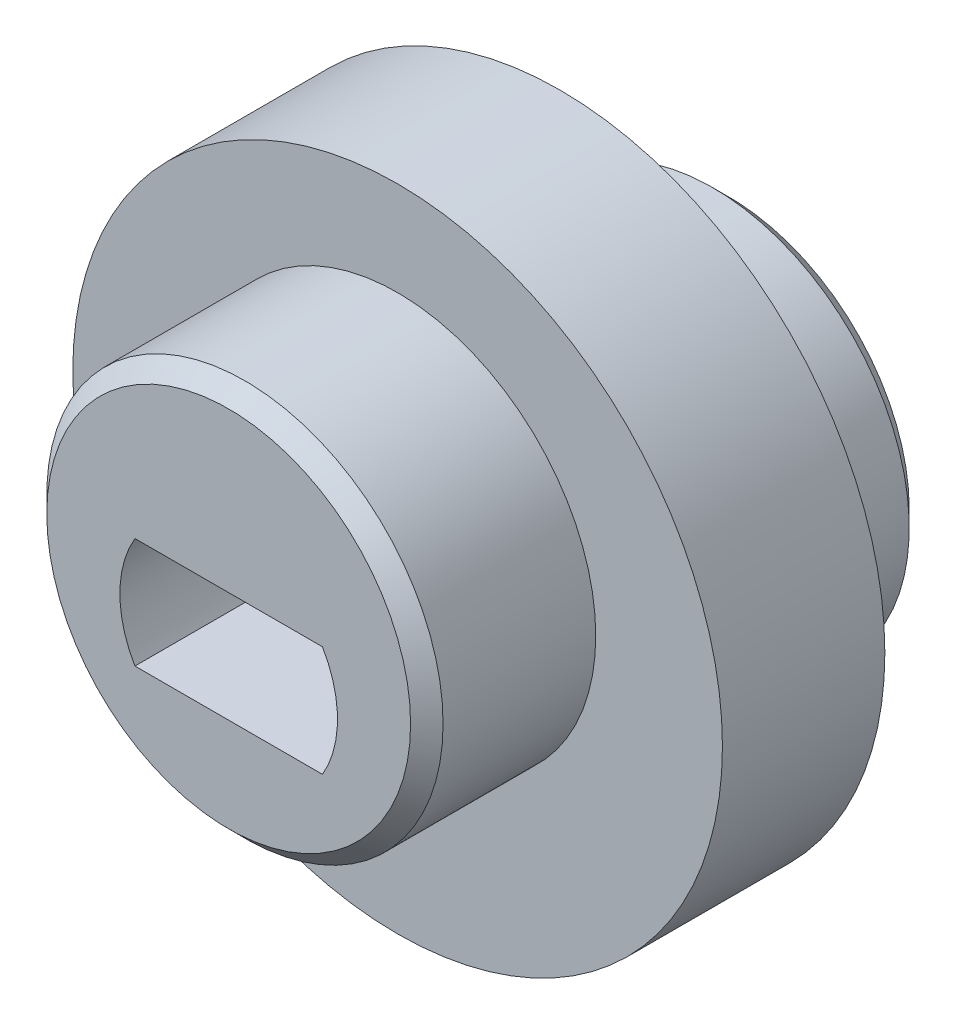
ISO-10303-21;
HEADER;
FILE_DESCRIPTION(('STEP AP214'),'2;1');
FILE_NAME('part.step','',(''),(''),'','','');
FILE_SCHEMA(('AUTOMOTIVE_DESIGN { 1 0 10303 214 1 1 1 1 }'));
ENDSEC;
DATA;
#1=APPLICATION_CONTEXT('core data for automotive mechanical design processes');
#2=APPLICATION_PROTOCOL_DEFINITION('international standard','automotive_design',2000,#1);
#3=PRODUCT_CONTEXT('',#1,'mechanical');
#4=PRODUCT('Part','Part','',(#3));
#5=PRODUCT_RELATED_PRODUCT_CATEGORY('part','',(#4));
#6=PRODUCT_DEFINITION_FORMATION('','',#4);
#7=PRODUCT_DEFINITION_CONTEXT('part definition',#1,'design');
#8=PRODUCT_DEFINITION('design','',#6,#7);
#9=PRODUCT_DEFINITION_SHAPE('','',#8);
#10=(LENGTH_UNIT() NAMED_UNIT(*) SI_UNIT(.MILLI.,.METRE.));
#11=(NAMED_UNIT(*) PLANE_ANGLE_UNIT() SI_UNIT($,.RADIAN.));
#12=(NAMED_UNIT(*) SI_UNIT($,.STERADIAN.) SOLID_ANGLE_UNIT());
#13=UNCERTAINTY_MEASURE_WITH_UNIT(LENGTH_MEASURE(1.E-05),#10,'distance_accuracy_value','');
#14=(GEOMETRIC_REPRESENTATION_CONTEXT(3) GLOBAL_UNCERTAINTY_ASSIGNED_CONTEXT((#13)) GLOBAL_UNIT_ASSIGNED_CONTEXT((#10,
#11,#12)) REPRESENTATION_CONTEXT('',''));
#15=CARTESIAN_POINT('',(0.,0.,0.));
#16=DIRECTION('',(0.,0.,1.));
#17=DIRECTION('',(1.,0.,0.));
#18=AXIS2_PLACEMENT_3D('',#15,#16,#17);
#19=CARTESIAN_POINT('',(0.,0.,2.5));
#20=DIRECTION('',(0.,0.,1.));
#21=DIRECTION('',(1.,0.,0.));
#22=AXIS2_PLACEMENT_3D('',#19,#20,#21);
#23=PLANE('',#22);
#24=CARTESIAN_POINT('',(0.,1.,2.5));
#25=DIRECTION('',(0.,0.,1.));
#26=DIRECTION('',(1.,0.,0.));
#27=AXIS2_PLACEMENT_3D('',#24,#25,#26);
#28=CIRCLE('',#27,6.1);
#29=CARTESIAN_POINT('',(6.1,1.,2.5));
#30=VERTEX_POINT('',#29);
#31=EDGE_CURVE('E127',#30,#30,#28,.T.);
#32=ORIENTED_EDGE('',*,*,#31,.F.);
#33=EDGE_LOOP('',(#32));
#34=FACE_BOUND('',#33,.T.);
#35=CARTESIAN_POINT('',(0.,0.,2.5));
#36=DIRECTION('',(0.,0.,1.));
#37=DIRECTION('',(1.,0.,0.));
#38=AXIS2_PLACEMENT_3D('',#35,#36,#37);
#39=CIRCLE('',#38,10.);
#40=CARTESIAN_POINT('',(10.,0.,2.5));
#41=VERTEX_POINT('',#40);
#42=EDGE_CURVE('E116',#41,#41,#39,.T.);
#43=ORIENTED_EDGE('',*,*,#42,.T.);
#44=EDGE_LOOP('',(#43));
#45=FACE_BOUND('',#44,.T.);
#46=ADVANCED_FACE('F41',(#34,#45),#23,.T.);
#47=CARTESIAN_POINT('',(0.,1.,7.7));
#48=DIRECTION('',(0.,0.,-1.));
#49=DIRECTION('',(-1.,0.,0.));
#50=AXIS2_PLACEMENT_3D('',#47,#48,#49);
#51=CYLINDRICAL_SURFACE('',#50,6.1);
#52=CARTESIAN_POINT('',(0.,1.,7.2));
#53=DIRECTION('',(0.,0.,1.));
#54=DIRECTION('',(1.,0.,0.));
#55=AXIS2_PLACEMENT_3D('',#52,#53,#54);
#56=CIRCLE('',#55,6.1);
#57=CARTESIAN_POINT('',(6.1,1.,7.2));
#58=VERTEX_POINT('',#57);
#59=EDGE_CURVE('E11',#58,#58,#56,.F.);
#60=ORIENTED_EDGE('',*,*,#59,.T.);
#61=EDGE_LOOP('',(#60));
#62=FACE_BOUND('',#61,.T.);
#63=ORIENTED_EDGE('',*,*,#31,.T.);
#64=EDGE_LOOP('',(#63));
#65=FACE_BOUND('',#64,.T.);
#66=ADVANCED_FACE('F148',(#62,#65),#51,.T.);
#67=CARTESIAN_POINT('',(0.,1.,7.7));
#68=DIRECTION('',(0.,0.,1.));
#69=DIRECTION('',(1.,0.,0.));
#70=AXIS2_PLACEMENT_3D('',#67,#68,#69);
#71=PLANE('',#70);
#72=CARTESIAN_POINT('',(0.,1.,7.7));
#73=DIRECTION('',(0.,0.,1.));
#74=DIRECTION('',(1.,0.,0.));
#75=AXIS2_PLACEMENT_3D('',#72,#73,#74);
#76=CIRCLE('',#75,5.6);
#77=CARTESIAN_POINT('',(5.6,1.,7.7));
#78=VERTEX_POINT('',#77);
#79=EDGE_CURVE('E50',#78,#78,#76,.T.);
#80=ORIENTED_EDGE('',*,*,#79,.T.);
#81=EDGE_LOOP('',(#80));
#82=FACE_BOUND('',#81,.T.);
#83=CARTESIAN_POINT('',(0.,0.,7.7));
#84=DIRECTION('',(0.,0.,1.));
#85=DIRECTION('',(1.,0.,0.));
#86=AXIS2_PLACEMENT_3D('',#83,#84,#85);
#87=CIRCLE('',#86,3.35);
#88=CARTESIAN_POINT('',(-2.88660700477221,1.7,7.7));
#89=VERTEX_POINT('',#88);
#90=CARTESIAN_POINT('',(-2.88660700477221,-1.7,7.7));
#91=VERTEX_POINT('',#90);
#92=EDGE_CURVE('E57',#89,#91,#87,.T.);
#93=ORIENTED_EDGE('',*,*,#92,.F.);
#94=DIRECTION('',(-1.,0.,0.));
#95=VECTOR('',#94,1.);
#96=CARTESIAN_POINT('',(-2.88660700477221,1.7,7.7));
#97=LINE('',#96,#95);
#98=CARTESIAN_POINT('',(2.88660700477221,1.7,7.7));
#99=VERTEX_POINT('',#98);
#100=EDGE_CURVE('E100',#99,#89,#97,.T.);
#101=ORIENTED_EDGE('',*,*,#100,.F.);
#102=CARTESIAN_POINT('',(0.,0.,7.7));
#103=DIRECTION('',(0.,0.,1.));
#104=DIRECTION('',(1.,0.,0.));
#105=AXIS2_PLACEMENT_3D('',#102,#103,#104);
#106=CIRCLE('',#105,3.35);
#107=CARTESIAN_POINT('',(2.88660700477221,-1.7,7.7));
#108=VERTEX_POINT('',#107);
#109=EDGE_CURVE('E85',#108,#99,#106,.T.);
#110=ORIENTED_EDGE('',*,*,#109,.F.);
#111=DIRECTION('',(1.,0.,0.));
#112=VECTOR('',#111,1.);
#113=CARTESIAN_POINT('',(-2.88660700477221,-1.7,7.7));
#114=LINE('',#113,#112);
#115=EDGE_CURVE('E94',#91,#108,#114,.T.);
#116=ORIENTED_EDGE('',*,*,#115,.F.);
#117=EDGE_LOOP('',(#93,#101,#110,#116));
#118=FACE_BOUND('',#117,.T.);
#119=ADVANCED_FACE('F98',(#82,#118),#71,.T.);
#120=CARTESIAN_POINT('',(0.,0.,-30.7842712474619));
#121=DIRECTION('',(0.,0.,1.));
#122=DIRECTION('',(1.,0.,0.));
#123=AXIS2_PLACEMENT_3D('',#120,#121,#122);
#124=CYLINDRICAL_SURFACE('',#123,10.);
#125=CARTESIAN_POINT('',(0.,0.,-2.5));
#126=DIRECTION('',(0.,0.,1.));
#127=DIRECTION('',(1.,0.,0.));
#128=AXIS2_PLACEMENT_3D('',#125,#126,#127);
#129=CIRCLE('',#128,10.);
#130=CARTESIAN_POINT('',(10.,0.,-2.5));
#131=VERTEX_POINT('',#130);
#132=EDGE_CURVE('E121',#131,#131,#129,.F.);
#133=ORIENTED_EDGE('',*,*,#132,.F.);
#134=EDGE_LOOP('',(#133));
#135=FACE_BOUND('',#134,.T.);
#136=ORIENTED_EDGE('',*,*,#42,.F.);
#137=EDGE_LOOP('',(#136));
#138=FACE_BOUND('',#137,.T.);
#139=ADVANCED_FACE('F184',(#135,#138),#124,.T.);
#140=CARTESIAN_POINT('',(0.,-1.,-7.7));
#141=DIRECTION('',(0.,0.,-1.));
#142=DIRECTION('',(-1.,0.,0.));
#143=AXIS2_PLACEMENT_3D('',#140,#141,#142);
#144=PLANE('',#143);
#145=CARTESIAN_POINT('',(0.,-1.,-7.7));
#146=DIRECTION('',(0.,0.,-1.));
#147=DIRECTION('',(-1.,0.,0.));
#148=AXIS2_PLACEMENT_3D('',#145,#146,#147);
#149=CIRCLE('',#148,5.55);
#150=CARTESIAN_POINT('',(-5.55,-1.,-7.7));
#151=VERTEX_POINT('',#150);
#152=EDGE_CURVE('E130',#151,#151,#149,.T.);
#153=ORIENTED_EDGE('',*,*,#152,.T.);
#154=EDGE_LOOP('',(#153));
#155=FACE_BOUND('',#154,.T.);
#156=CARTESIAN_POINT('',(0.,0.,-7.7));
#157=DIRECTION('',(0.,0.,1.));
#158=DIRECTION('',(1.,0.,0.));
#159=AXIS2_PLACEMENT_3D('',#156,#157,#158);
#160=CIRCLE('',#159,3.35);
#161=CARTESIAN_POINT('',(-2.88660700477221,1.7,-7.7));
#162=VERTEX_POINT('',#161);
#163=CARTESIAN_POINT('',(-2.88660700477221,-1.7,-7.7));
#164=VERTEX_POINT('',#163);
#165=EDGE_CURVE('E102',#162,#164,#160,.T.);
#166=ORIENTED_EDGE('',*,*,#165,.T.);
#167=DIRECTION('',(1.,0.,0.));
#168=VECTOR('',#167,1.);
#169=CARTESIAN_POINT('',(-2.88660700477221,-1.7,-7.7));
#170=LINE('',#169,#168);
#171=CARTESIAN_POINT('',(2.88660700477221,-1.7,-7.7));
#172=VERTEX_POINT('',#171);
#173=EDGE_CURVE('E108',#164,#172,#170,.T.);
#174=ORIENTED_EDGE('',*,*,#173,.T.);
#175=CARTESIAN_POINT('',(0.,0.,-7.7));
#176=DIRECTION('',(0.,0.,1.));
#177=DIRECTION('',(1.,0.,0.));
#178=AXIS2_PLACEMENT_3D('',#175,#176,#177);
#179=CIRCLE('',#178,3.35);
#180=CARTESIAN_POINT('',(2.88660700477221,1.7,-7.7));
#181=VERTEX_POINT('',#180);
#182=EDGE_CURVE('E65',#172,#181,#179,.T.);
#183=ORIENTED_EDGE('',*,*,#182,.T.);
#184=DIRECTION('',(-1.,0.,0.));
#185=VECTOR('',#184,1.);
#186=CARTESIAN_POINT('',(-2.88660700477221,1.7,-7.7));
#187=LINE('',#186,#185);
#188=EDGE_CURVE('E111',#181,#162,#187,.T.);
#189=ORIENTED_EDGE('',*,*,#188,.T.);
#190=EDGE_LOOP('',(#166,#174,#183,#189));
#191=FACE_BOUND('',#190,.T.);
#192=ADVANCED_FACE('F177',(#155,#191),#144,.T.);
#193=CARTESIAN_POINT('',(0.,-1.,-7.7));
#194=DIRECTION('',(0.,0.,1.));
#195=DIRECTION('',(1.,0.,0.));
#196=AXIS2_PLACEMENT_3D('',#193,#194,#195);
#197=CYLINDRICAL_SURFACE('',#196,6.05);
#198=CARTESIAN_POINT('',(0.,-1.,-7.2));
#199=DIRECTION('',(0.,0.,-1.));
#200=DIRECTION('',(-1.,0.,0.));
#201=AXIS2_PLACEMENT_3D('',#198,#199,#200);
#202=CIRCLE('',#201,6.05);
#203=CARTESIAN_POINT('',(-6.05,-1.,-7.2));
#204=VERTEX_POINT('',#203);
#205=EDGE_CURVE('E133',#204,#204,#202,.F.);
#206=ORIENTED_EDGE('',*,*,#205,.T.);
#207=EDGE_LOOP('',(#206));
#208=FACE_BOUND('',#207,.T.);
#209=CARTESIAN_POINT('',(0.,-1.,-2.5));
#210=DIRECTION('',(0.,0.,-1.));
#211=DIRECTION('',(-1.,0.,0.));
#212=AXIS2_PLACEMENT_3D('',#209,#210,#211);
#213=CIRCLE('',#212,6.05);
#214=CARTESIAN_POINT('',(-6.05,-1.,-2.5));
#215=VERTEX_POINT('',#214);
#216=EDGE_CURVE('E124',#215,#215,#213,.T.);
#217=ORIENTED_EDGE('',*,*,#216,.T.);
#218=EDGE_LOOP('',(#217));
#219=FACE_BOUND('',#218,.T.);
#220=ADVANCED_FACE('F164',(#208,#219),#197,.T.);
#221=CARTESIAN_POINT('',(0.,0.,-2.5));
#222=DIRECTION('',(0.,0.,1.));
#223=DIRECTION('',(1.,0.,0.));
#224=AXIS2_PLACEMENT_3D('',#221,#222,#223);
#225=PLANE('',#224);
#226=ORIENTED_EDGE('',*,*,#216,.F.);
#227=EDGE_LOOP('',(#226));
#228=FACE_BOUND('',#227,.T.);
#229=ORIENTED_EDGE('',*,*,#132,.T.);
#230=EDGE_LOOP('',(#229));
#231=FACE_BOUND('',#230,.T.);
#232=ADVANCED_FACE('F161',(#228,#231),#225,.F.);
#233=CARTESIAN_POINT('',(0.,0.,-7.7));
#234=DIRECTION('',(0.,0.,1.));
#235=DIRECTION('',(1.,0.,0.));
#236=AXIS2_PLACEMENT_3D('',#233,#234,#235);
#237=CYLINDRICAL_SURFACE('',#236,3.35);
#238=DIRECTION('',(0.,0.,1.));
#239=VECTOR('',#238,1.);
#240=CARTESIAN_POINT('',(-2.88660700477221,-1.7,-7.7));
#241=LINE('',#240,#239);
#242=EDGE_CURVE('E91',#164,#91,#241,.T.);
#243=ORIENTED_EDGE('',*,*,#242,.F.);
#244=ORIENTED_EDGE('',*,*,#165,.F.);
#245=DIRECTION('',(0.,0.,1.));
#246=VECTOR('',#245,1.);
#247=CARTESIAN_POINT('',(-2.88660700477221,1.7,-7.7));
#248=LINE('',#247,#246);
#249=EDGE_CURVE('E114',#162,#89,#248,.T.);
#250=ORIENTED_EDGE('',*,*,#249,.T.);
#251=ORIENTED_EDGE('',*,*,#92,.T.);
#252=EDGE_LOOP('',(#243,#244,#250,#251));
#253=FACE_BOUND('',#252,.T.);
#254=ADVANCED_FACE('F163',(#253),#237,.F.);
#255=CARTESIAN_POINT('',(-2.88660700477221,1.7,-7.7));
#256=DIRECTION('',(0.,1.,0.));
#257=DIRECTION('',(-1.,0.,0.));
#258=AXIS2_PLACEMENT_3D('',#255,#256,#257);
#259=PLANE('',#258);
#260=ORIENTED_EDGE('',*,*,#249,.F.);
#261=ORIENTED_EDGE('',*,*,#188,.F.);
#262=DIRECTION('',(0.,0.,1.));
#263=VECTOR('',#262,1.);
#264=CARTESIAN_POINT('',(2.88660700477221,1.7,-7.7));
#265=LINE('',#264,#263);
#266=EDGE_CURVE('E90',#181,#99,#265,.T.);
#267=ORIENTED_EDGE('',*,*,#266,.T.);
#268=ORIENTED_EDGE('',*,*,#100,.T.);
#269=EDGE_LOOP('',(#260,#261,#267,#268));
#270=FACE_BOUND('',#269,.T.);
#271=ADVANCED_FACE('F174',(#270),#259,.F.);
#272=CARTESIAN_POINT('',(0.,0.,-7.7));
#273=DIRECTION('',(0.,0.,1.));
#274=DIRECTION('',(1.,0.,0.));
#275=AXIS2_PLACEMENT_3D('',#272,#273,#274);
#276=CYLINDRICAL_SURFACE('',#275,3.35);
#277=ORIENTED_EDGE('',*,*,#266,.F.);
#278=ORIENTED_EDGE('',*,*,#182,.F.);
#279=DIRECTION('',(0.,0.,1.));
#280=VECTOR('',#279,1.);
#281=CARTESIAN_POINT('',(2.88660700477221,-1.7,-7.7));
#282=LINE('',#281,#280);
#283=EDGE_CURVE('E81',#172,#108,#282,.T.);
#284=ORIENTED_EDGE('',*,*,#283,.T.);
#285=ORIENTED_EDGE('',*,*,#109,.T.);
#286=EDGE_LOOP('',(#277,#278,#284,#285));
#287=FACE_BOUND('',#286,.T.);
#288=ADVANCED_FACE('F83',(#287),#276,.F.);
#289=CARTESIAN_POINT('',(-2.88660700477221,-1.7,-7.7));
#290=DIRECTION('',(0.,-1.,0.));
#291=DIRECTION('',(0.,0.,-1.));
#292=AXIS2_PLACEMENT_3D('',#289,#290,#291);
#293=PLANE('',#292);
#294=ORIENTED_EDGE('',*,*,#283,.F.);
#295=ORIENTED_EDGE('',*,*,#173,.F.);
#296=ORIENTED_EDGE('',*,*,#242,.T.);
#297=ORIENTED_EDGE('',*,*,#115,.T.);
#298=EDGE_LOOP('',(#294,#295,#296,#297));
#299=FACE_BOUND('',#298,.T.);
#300=ADVANCED_FACE('F95',(#299),#293,.F.);
#301=CARTESIAN_POINT('',(0.,-1.,-7.7));
#302=DIRECTION('',(0.,0.,1.));
#303=DIRECTION('',(1.,0.,0.));
#304=AXIS2_PLACEMENT_3D('',#301,#302,#303);
#305=CONICAL_SURFACE('',#304,5.55,0.785398163397445);
#306=ORIENTED_EDGE('',*,*,#205,.F.);
#307=EDGE_LOOP('',(#306));
#308=FACE_BOUND('',#307,.T.);
#309=ORIENTED_EDGE('',*,*,#152,.F.);
#310=EDGE_LOOP('',(#309));
#311=FACE_BOUND('',#310,.T.);
#312=ADVANCED_FACE('F140',(#308,#311),#305,.T.);
#313=CARTESIAN_POINT('',(0.,1.,7.7));
#314=DIRECTION('',(0.,0.,-1.));
#315=DIRECTION('',(-1.,0.,0.));
#316=AXIS2_PLACEMENT_3D('',#313,#314,#315);
#317=CONICAL_SURFACE('',#316,5.6,0.785398163397448);
#318=ORIENTED_EDGE('',*,*,#59,.F.);
#319=EDGE_LOOP('',(#318));
#320=FACE_BOUND('',#319,.T.);
#321=ORIENTED_EDGE('',*,*,#79,.F.);
#322=EDGE_LOOP('',(#321));
#323=FACE_BOUND('',#322,.T.);
#324=ADVANCED_FACE('F44',(#320,#323),#317,.T.);
#325=CLOSED_SHELL('',(#46,#66,#119,#139,#192,#220,#232,#254,#271,#288,#300,#312,#324));
#326=MANIFOLD_SOLID_BREP('B2',#325);
#327=ADVANCED_BREP_SHAPE_REPRESENTATION('',(#18,#326),#14);
#328=SHAPE_DEFINITION_REPRESENTATION(#9,#327);
ENDSEC;
END-ISO-10303-21;
